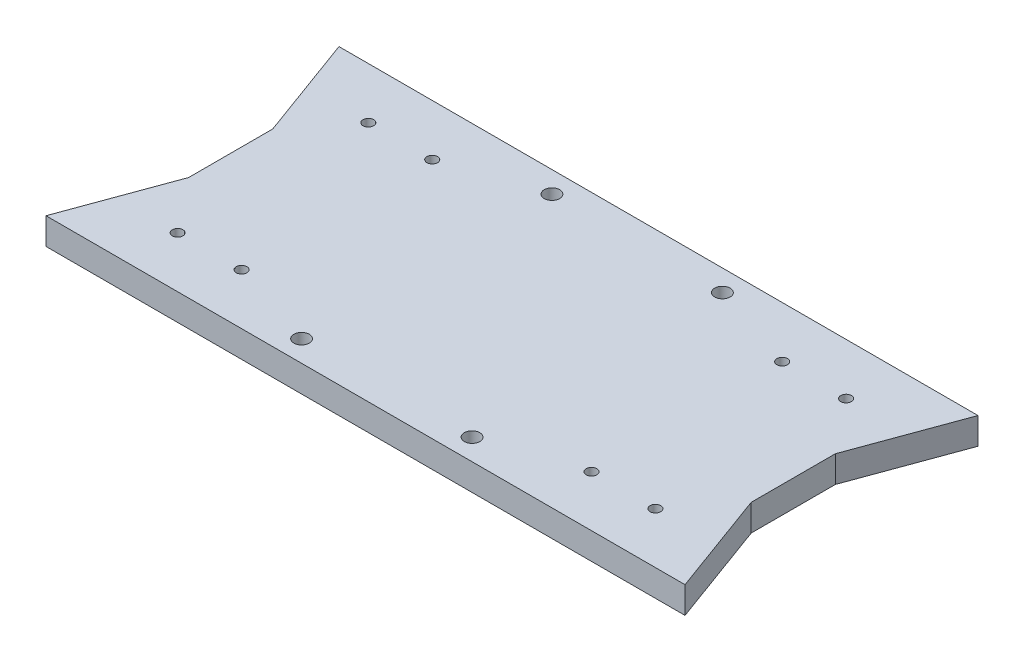
ISO-10303-21;
HEADER;
FILE_DESCRIPTION(('STEP AP214'),'2;1');
FILE_NAME('part.step','',(''),(''),'','','');
FILE_SCHEMA(('AUTOMOTIVE_DESIGN { 1 0 10303 214 1 1 1 1 }'));
ENDSEC;
DATA;
#1=APPLICATION_CONTEXT('core data for automotive mechanical design processes');
#2=APPLICATION_PROTOCOL_DEFINITION('international standard','automotive_design',2000,#1);
#3=PRODUCT_CONTEXT('',#1,'mechanical');
#4=PRODUCT('Part','Part','',(#3));
#5=PRODUCT_RELATED_PRODUCT_CATEGORY('part','',(#4));
#6=PRODUCT_DEFINITION_FORMATION('','',#4);
#7=PRODUCT_DEFINITION_CONTEXT('part definition',#1,'design');
#8=PRODUCT_DEFINITION('design','',#6,#7);
#9=PRODUCT_DEFINITION_SHAPE('','',#8);
#10=(LENGTH_UNIT() NAMED_UNIT(*) SI_UNIT(.MILLI.,.METRE.));
#11=(NAMED_UNIT(*) PLANE_ANGLE_UNIT() SI_UNIT($,.RADIAN.));
#12=(NAMED_UNIT(*) SI_UNIT($,.STERADIAN.) SOLID_ANGLE_UNIT());
#13=UNCERTAINTY_MEASURE_WITH_UNIT(LENGTH_MEASURE(1.E-05),#10,'distance_accuracy_value','');
#14=(GEOMETRIC_REPRESENTATION_CONTEXT(3) GLOBAL_UNCERTAINTY_ASSIGNED_CONTEXT((#13)) GLOBAL_UNIT_ASSIGNED_CONTEXT((#10,
#11,#12)) REPRESENTATION_CONTEXT('',''));
#15=CARTESIAN_POINT('',(0.,0.,0.));
#16=DIRECTION('',(0.,0.,1.));
#17=DIRECTION('',(1.,0.,0.));
#18=AXIS2_PLACEMENT_3D('',#15,#16,#17);
#19=CARTESIAN_POINT('',(-105.394952442636,6.35,-32.7826613509761));
#20=DIRECTION('',(-1.,0.,0.));
#21=DIRECTION('',(0.,0.,1.));
#22=AXIS2_PLACEMENT_3D('',#19,#20,#21);
#23=PLANE('',#22);
#24=DIRECTION('',(0.,0.,1.));
#25=VECTOR('',#24,1.);
#26=CARTESIAN_POINT('',(-105.394952442636,6.35,-32.7826613509761));
#27=LINE('',#26,#25);
#28=CARTESIAN_POINT('',(-105.394952442636,6.35,-77.7376613569761));
#29=VERTEX_POINT('',#28);
#30=CARTESIAN_POINT('',(-105.394952442636,6.35,-57.6776613449761));
#31=VERTEX_POINT('',#30);
#32=EDGE_CURVE('E100',#29,#31,#27,.T.);
#33=ORIENTED_EDGE('',*,*,#32,.F.);
#34=DIRECTION('',(0.,1.,0.));
#35=VECTOR('',#34,1.);
#36=CARTESIAN_POINT('',(-105.394952442636,0.,-77.7376613569761));
#37=LINE('',#36,#35);
#38=CARTESIAN_POINT('',(-105.394952442636,0.,-77.7376613569761));
#39=VERTEX_POINT('',#38);
#40=EDGE_CURVE('E129',#39,#29,#37,.T.);
#41=ORIENTED_EDGE('',*,*,#40,.F.);
#42=DIRECTION('',(0.,0.,-1.));
#43=VECTOR('',#42,1.);
#44=CARTESIAN_POINT('',(-105.394952442636,0.,-32.7826613509761));
#45=LINE('',#44,#43);
#46=CARTESIAN_POINT('',(-105.394952442636,0.,-57.6776613449761));
#47=VERTEX_POINT('',#46);
#48=EDGE_CURVE('E52',#47,#39,#45,.T.);
#49=ORIENTED_EDGE('',*,*,#48,.F.);
#50=DIRECTION('',(0.,1.,0.));
#51=VECTOR('',#50,1.);
#52=CARTESIAN_POINT('',(-105.394952442636,0.,-57.6776613449761));
#53=LINE('',#52,#51);
#54=EDGE_CURVE('E111',#47,#31,#53,.T.);
#55=ORIENTED_EDGE('',*,*,#54,.T.);
#56=EDGE_LOOP('',(#33,#41,#49,#55));
#57=FACE_BOUND('',#56,.T.);
#58=ADVANCED_FACE('F35',(#57),#23,.T.);
#59=CARTESIAN_POINT('',(0.,6.35,0.));
#60=DIRECTION('',(0.,-1.,0.));
#61=DIRECTION('',(0.,0.,-1.));
#62=AXIS2_PLACEMENT_3D('',#59,#60,#61);
#63=PLANE('',#62);
#64=CARTESIAN_POINT('',(-58.653665481045,6.35,-37.8626613509761));
#65=DIRECTION('',(0.,1.,0.));
#66=DIRECTION('',(0.,0.,1.));
#67=AXIS2_PLACEMENT_3D('',#64,#65,#66);
#68=CIRCLE('',#67,1.8415);
#69=CARTESIAN_POINT('',(-58.653665481045,6.35,-36.0211613509761));
#70=VERTEX_POINT('',#69);
#71=EDGE_CURVE('E447',#70,#70,#68,.T.);
#72=ORIENTED_EDGE('',*,*,#71,.F.);
#73=EDGE_LOOP('',(#72));
#74=FACE_BOUND('',#73,.T.);
#75=CARTESIAN_POINT('',(-18.013665481045,6.35,-37.8626613509761));
#76=DIRECTION('',(0.,1.,0.));
#77=DIRECTION('',(0.,0.,1.));
#78=AXIS2_PLACEMENT_3D('',#75,#76,#77);
#79=CIRCLE('',#78,1.8415);
#80=CARTESIAN_POINT('',(-18.013665481045,6.35,-36.0211613509761));
#81=VERTEX_POINT('',#80);
#82=EDGE_CURVE('E444',#81,#81,#79,.T.);
#83=ORIENTED_EDGE('',*,*,#82,.F.);
#84=EDGE_LOOP('',(#83));
#85=FACE_BOUND('',#84,.T.);
#86=CARTESIAN_POINT('',(-18.0136654810452,6.35,-97.552661350976));
#87=DIRECTION('',(0.,1.,0.));
#88=DIRECTION('',(0.,0.,1.));
#89=AXIS2_PLACEMENT_3D('',#86,#87,#88);
#90=CIRCLE('',#89,1.84149999999999);
#91=CARTESIAN_POINT('',(-18.0136654810452,6.35,-95.711161350976));
#92=VERTEX_POINT('',#91);
#93=EDGE_CURVE('E446',#92,#92,#90,.T.);
#94=ORIENTED_EDGE('',*,*,#93,.F.);
#95=EDGE_LOOP('',(#94));
#96=FACE_BOUND('',#95,.T.);
#97=CARTESIAN_POINT('',(-58.6536654810452,6.35,-97.552661350976));
#98=DIRECTION('',(0.,1.,0.));
#99=DIRECTION('',(0.,0.,1.));
#100=AXIS2_PLACEMENT_3D('',#97,#98,#99);
#101=CIRCLE('',#100,1.84149999999999);
#102=CARTESIAN_POINT('',(-58.6536654810452,6.35,-95.711161350976));
#103=VERTEX_POINT('',#102);
#104=EDGE_CURVE('E216',#103,#103,#101,.T.);
#105=ORIENTED_EDGE('',*,*,#104,.F.);
#106=EDGE_LOOP('',(#105));
#107=FACE_BOUND('',#106,.T.);
#108=ORIENTED_EDGE('',*,*,#32,.T.);
#109=DIRECTION('',(0.343774305183413,0.,-0.939052302641158));
#110=VECTOR('',#109,1.);
#111=CARTESIAN_POINT('',(-105.394952442636,6.35,-57.6776613449761));
#112=LINE('',#111,#110);
#113=CARTESIAN_POINT('',(-114.508674118636,6.35,-32.7826613509761));
#114=VERTEX_POINT('',#113);
#115=EDGE_CURVE('E104',#114,#31,#112,.T.);
#116=ORIENTED_EDGE('',*,*,#115,.F.);
#117=DIRECTION('',(1.,0.,0.));
#118=VECTOR('',#117,1.);
#119=CARTESIAN_POINT('',(-38.3336654810452,6.35,-32.7826613509761));
#120=LINE('',#119,#118);
#121=CARTESIAN_POINT('',(37.8413431565453,6.35,-32.7826613509761));
#122=VERTEX_POINT('',#121);
#123=EDGE_CURVE('E44',#114,#122,#120,.T.);
#124=ORIENTED_EDGE('',*,*,#123,.T.);
#125=DIRECTION('',(-0.343774305183413,0.,-0.939052302641158));
#126=VECTOR('',#125,1.);
#127=CARTESIAN_POINT('',(28.7276214805453,6.35,-57.6776613449761));
#128=LINE('',#127,#126);
#129=CARTESIAN_POINT('',(28.7276214805453,6.35,-57.6776613449761));
#130=VERTEX_POINT('',#129);
#131=EDGE_CURVE('E158',#122,#130,#128,.T.);
#132=ORIENTED_EDGE('',*,*,#131,.T.);
#133=DIRECTION('',(0.,0.,1.));
#134=VECTOR('',#133,1.);
#135=CARTESIAN_POINT('',(28.7276214805453,6.35,-32.7826613509761));
#136=LINE('',#135,#134);
#137=CARTESIAN_POINT('',(28.7276214805453,6.35,-77.7376613569761));
#138=VERTEX_POINT('',#137);
#139=EDGE_CURVE('E108',#138,#130,#136,.T.);
#140=ORIENTED_EDGE('',*,*,#139,.F.);
#141=DIRECTION('',(0.343774305183414,0.,-0.939052302641158));
#142=VECTOR('',#141,1.);
#143=CARTESIAN_POINT('',(37.8413431565453,6.35,-102.632661350976));
#144=LINE('',#143,#142);
#145=CARTESIAN_POINT('',(37.8413431565453,6.35,-102.632661350976));
#146=VERTEX_POINT('',#145);
#147=EDGE_CURVE('E167',#138,#146,#144,.T.);
#148=ORIENTED_EDGE('',*,*,#147,.T.);
#149=DIRECTION('',(-1.,0.,0.));
#150=VECTOR('',#149,1.);
#151=CARTESIAN_POINT('',(-38.3336654810452,6.35,-102.632661350976));
#152=LINE('',#151,#150);
#153=CARTESIAN_POINT('',(-114.508674118636,6.35,-102.632661350976));
#154=VERTEX_POINT('',#153);
#155=EDGE_CURVE('E11',#146,#154,#152,.T.);
#156=ORIENTED_EDGE('',*,*,#155,.T.);
#157=DIRECTION('',(-0.343774305183414,0.,-0.939052302641158));
#158=VECTOR('',#157,1.);
#159=CARTESIAN_POINT('',(-114.508674118636,6.35,-102.632661350976));
#160=LINE('',#159,#158);
#161=EDGE_CURVE('E106',#29,#154,#160,.T.);
#162=ORIENTED_EDGE('',*,*,#161,.F.);
#163=EDGE_LOOP('',(#108,#116,#124,#132,#140,#148,#156,#162));
#164=FACE_BOUND('',#163,.T.);
#165=CARTESIAN_POINT('',(18.6213431565454,6.35,-44.9476613509761));
#166=DIRECTION('',(0.,1.,0.));
#167=DIRECTION('',(0.,0.,1.));
#168=AXIS2_PLACEMENT_3D('',#165,#166,#167);
#169=CIRCLE('',#168,1.27);
#170=CARTESIAN_POINT('',(18.6213431565454,6.35,-43.6776613509761));
#171=VERTEX_POINT('',#170);
#172=EDGE_CURVE('E182',#171,#171,#169,.T.);
#173=ORIENTED_EDGE('',*,*,#172,.F.);
#174=EDGE_LOOP('',(#173));
#175=FACE_BOUND('',#174,.T.);
#176=CARTESIAN_POINT('',(3.38134315654538,6.35,-44.9476613509761));
#177=DIRECTION('',(0.,1.,0.));
#178=DIRECTION('',(0.,0.,1.));
#179=AXIS2_PLACEMENT_3D('',#176,#177,#178);
#180=CIRCLE('',#179,1.27);
#181=CARTESIAN_POINT('',(3.38134315654538,6.35,-43.6776613509761));
#182=VERTEX_POINT('',#181);
#183=EDGE_CURVE('E188',#182,#182,#180,.T.);
#184=ORIENTED_EDGE('',*,*,#183,.F.);
#185=EDGE_LOOP('',(#184));
#186=FACE_BOUND('',#185,.T.);
#187=CARTESIAN_POINT('',(18.6213431565454,6.35,-90.4076613509761));
#188=DIRECTION('',(0.,1.,0.));
#189=DIRECTION('',(0.,0.,1.));
#190=AXIS2_PLACEMENT_3D('',#187,#188,#189);
#191=CIRCLE('',#190,1.27000000000001);
#192=CARTESIAN_POINT('',(18.6213431565454,6.35,-89.137661350976));
#193=VERTEX_POINT('',#192);
#194=EDGE_CURVE('E194',#193,#193,#191,.T.);
#195=ORIENTED_EDGE('',*,*,#194,.F.);
#196=EDGE_LOOP('',(#195));
#197=FACE_BOUND('',#196,.T.);
#198=CARTESIAN_POINT('',(3.38134315654538,6.35,-90.4076613509761));
#199=DIRECTION('',(0.,1.,0.));
#200=DIRECTION('',(0.,0.,1.));
#201=AXIS2_PLACEMENT_3D('',#198,#199,#200);
#202=CIRCLE('',#201,1.27000000000001);
#203=CARTESIAN_POINT('',(3.38134315654538,6.35,-89.137661350976));
#204=VERTEX_POINT('',#203);
#205=EDGE_CURVE('E200',#204,#204,#202,.T.);
#206=ORIENTED_EDGE('',*,*,#205,.F.);
#207=EDGE_LOOP('',(#206));
#208=FACE_BOUND('',#207,.T.);
#209=CARTESIAN_POINT('',(-95.2886741186358,6.35,-44.9476613509761));
#210=DIRECTION('',(0.,-1.,0.));
#211=DIRECTION('',(0.,0.,1.));
#212=AXIS2_PLACEMENT_3D('',#209,#210,#211);
#213=CIRCLE('',#212,1.27);
#214=CARTESIAN_POINT('',(-95.2886741186358,6.35,-43.6776613509761));
#215=VERTEX_POINT('',#214);
#216=EDGE_CURVE('E134',#215,#215,#213,.T.);
#217=ORIENTED_EDGE('',*,*,#216,.T.);
#218=EDGE_LOOP('',(#217));
#219=FACE_BOUND('',#218,.T.);
#220=CARTESIAN_POINT('',(-80.0486741186358,6.35,-44.9476613509761));
#221=DIRECTION('',(0.,-1.,0.));
#222=DIRECTION('',(0.,0.,1.));
#223=AXIS2_PLACEMENT_3D('',#220,#221,#222);
#224=CIRCLE('',#223,1.27);
#225=CARTESIAN_POINT('',(-80.0486741186358,6.35,-43.6776613509761));
#226=VERTEX_POINT('',#225);
#227=EDGE_CURVE('E140',#226,#226,#224,.T.);
#228=ORIENTED_EDGE('',*,*,#227,.T.);
#229=EDGE_LOOP('',(#228));
#230=FACE_BOUND('',#229,.T.);
#231=CARTESIAN_POINT('',(-95.2886741186358,6.35,-90.4076613509761));
#232=DIRECTION('',(0.,-1.,0.));
#233=DIRECTION('',(0.,0.,1.));
#234=AXIS2_PLACEMENT_3D('',#231,#232,#233);
#235=CIRCLE('',#234,1.27000000000001);
#236=CARTESIAN_POINT('',(-95.2886741186358,6.35,-89.137661350976));
#237=VERTEX_POINT('',#236);
#238=EDGE_CURVE('E146',#237,#237,#235,.T.);
#239=ORIENTED_EDGE('',*,*,#238,.T.);
#240=EDGE_LOOP('',(#239));
#241=FACE_BOUND('',#240,.T.);
#242=CARTESIAN_POINT('',(-80.0486741186358,6.35,-90.4076613509761));
#243=DIRECTION('',(0.,-1.,0.));
#244=DIRECTION('',(0.,0.,1.));
#245=AXIS2_PLACEMENT_3D('',#242,#243,#244);
#246=CIRCLE('',#245,1.27000000000001);
#247=CARTESIAN_POINT('',(-80.0486741186358,6.35,-89.137661350976));
#248=VERTEX_POINT('',#247);
#249=EDGE_CURVE('E152',#248,#248,#246,.T.);
#250=ORIENTED_EDGE('',*,*,#249,.T.);
#251=EDGE_LOOP('',(#250));
#252=FACE_BOUND('',#251,.T.);
#253=ADVANCED_FACE('F101',(#74,#85,#96,#107,#164,#175,#186,#197,#208,#219,#230,#241,#252),#63,.F.);
#254=CARTESIAN_POINT('',(0.,0.,0.));
#255=DIRECTION('',(0.,-1.,0.));
#256=DIRECTION('',(0.,0.,-1.));
#257=AXIS2_PLACEMENT_3D('',#254,#255,#256);
#258=PLANE('',#257);
#259=CARTESIAN_POINT('',(-58.653665481045,0.,-37.8626613509761));
#260=DIRECTION('',(0.,-1.,0.));
#261=DIRECTION('',(0.,0.,-1.));
#262=AXIS2_PLACEMENT_3D('',#259,#260,#261);
#263=CIRCLE('',#262,1.8415);
#264=CARTESIAN_POINT('',(-58.653665481045,0.,-39.7041613509761));
#265=VERTEX_POINT('',#264);
#266=EDGE_CURVE('E39',#265,#265,#263,.T.);
#267=ORIENTED_EDGE('',*,*,#266,.F.);
#268=EDGE_LOOP('',(#267));
#269=FACE_BOUND('',#268,.T.);
#270=CARTESIAN_POINT('',(-18.013665481045,0.,-37.8626613509761));
#271=DIRECTION('',(0.,-1.,0.));
#272=DIRECTION('',(0.,0.,-1.));
#273=AXIS2_PLACEMENT_3D('',#270,#271,#272);
#274=CIRCLE('',#273,1.8415);
#275=CARTESIAN_POINT('',(-18.013665481045,0.,-39.7041613509761));
#276=VERTEX_POINT('',#275);
#277=EDGE_CURVE('E218',#276,#276,#274,.T.);
#278=ORIENTED_EDGE('',*,*,#277,.F.);
#279=EDGE_LOOP('',(#278));
#280=FACE_BOUND('',#279,.T.);
#281=CARTESIAN_POINT('',(-18.0136654810452,0.,-97.552661350976));
#282=DIRECTION('',(0.,-1.,0.));
#283=DIRECTION('',(0.,0.,-1.));
#284=AXIS2_PLACEMENT_3D('',#281,#282,#283);
#285=CIRCLE('',#284,1.84149999999999);
#286=CARTESIAN_POINT('',(-18.0136654810452,0.,-99.394161350976));
#287=VERTEX_POINT('',#286);
#288=EDGE_CURVE('E215',#287,#287,#285,.T.);
#289=ORIENTED_EDGE('',*,*,#288,.F.);
#290=EDGE_LOOP('',(#289));
#291=FACE_BOUND('',#290,.T.);
#292=CARTESIAN_POINT('',(-58.6536654810452,0.,-97.552661350976));
#293=DIRECTION('',(0.,-1.,0.));
#294=DIRECTION('',(0.,0.,-1.));
#295=AXIS2_PLACEMENT_3D('',#292,#293,#294);
#296=CIRCLE('',#295,1.84149999999999);
#297=CARTESIAN_POINT('',(-58.6536654810452,0.,-99.394161350976));
#298=VERTEX_POINT('',#297);
#299=EDGE_CURVE('E212',#298,#298,#296,.T.);
#300=ORIENTED_EDGE('',*,*,#299,.F.);
#301=EDGE_LOOP('',(#300));
#302=FACE_BOUND('',#301,.T.);
#303=CARTESIAN_POINT('',(3.38134315654538,0.,-44.9476613509761));
#304=DIRECTION('',(0.,1.,0.));
#305=DIRECTION('',(0.,0.,1.));
#306=AXIS2_PLACEMENT_3D('',#303,#304,#305);
#307=CIRCLE('',#306,1.27);
#308=CARTESIAN_POINT('',(3.38134315654538,0.,-43.6776613509761));
#309=VERTEX_POINT('',#308);
#310=EDGE_CURVE('E185',#309,#309,#307,.T.);
#311=ORIENTED_EDGE('',*,*,#310,.T.);
#312=EDGE_LOOP('',(#311));
#313=FACE_BOUND('',#312,.T.);
#314=CARTESIAN_POINT('',(3.38134315654538,0.,-90.4076613509761));
#315=DIRECTION('',(0.,1.,0.));
#316=DIRECTION('',(0.,0.,1.));
#317=AXIS2_PLACEMENT_3D('',#314,#315,#316);
#318=CIRCLE('',#317,1.27000000000001);
#319=CARTESIAN_POINT('',(3.38134315654538,0.,-89.137661350976));
#320=VERTEX_POINT('',#319);
#321=EDGE_CURVE('E197',#320,#320,#318,.T.);
#322=ORIENTED_EDGE('',*,*,#321,.T.);
#323=EDGE_LOOP('',(#322));
#324=FACE_BOUND('',#323,.T.);
#325=DIRECTION('',(1.,0.,0.));
#326=VECTOR('',#325,1.);
#327=CARTESIAN_POINT('',(-38.3336654810452,0.,-32.7826613509761));
#328=LINE('',#327,#326);
#329=CARTESIAN_POINT('',(-114.508674118636,0.,-32.7826613509761));
#330=VERTEX_POINT('',#329);
#331=CARTESIAN_POINT('',(37.8413431565453,0.,-32.7826613509761));
#332=VERTEX_POINT('',#331);
#333=EDGE_CURVE('E203',#330,#332,#328,.T.);
#334=ORIENTED_EDGE('',*,*,#333,.F.);
#335=DIRECTION('',(0.343774305183413,0.,-0.939052302641158));
#336=VECTOR('',#335,1.);
#337=CARTESIAN_POINT('',(-105.394952442636,0.,-57.6776613449761));
#338=LINE('',#337,#336);
#339=EDGE_CURVE('E115',#330,#47,#338,.T.);
#340=ORIENTED_EDGE('',*,*,#339,.T.);
#341=ORIENTED_EDGE('',*,*,#48,.T.);
#342=DIRECTION('',(-0.343774305183414,0.,-0.939052302641158));
#343=VECTOR('',#342,1.);
#344=CARTESIAN_POINT('',(-114.508674118636,0.,-102.632661350976));
#345=LINE('',#344,#343);
#346=CARTESIAN_POINT('',(-114.508674118636,0.,-102.632661350976));
#347=VERTEX_POINT('',#346);
#348=EDGE_CURVE('E125',#39,#347,#345,.T.);
#349=ORIENTED_EDGE('',*,*,#348,.T.);
#350=DIRECTION('',(-1.,0.,0.));
#351=VECTOR('',#350,1.);
#352=CARTESIAN_POINT('',(-38.3336654810452,0.,-102.632661350976));
#353=LINE('',#352,#351);
#354=CARTESIAN_POINT('',(37.8413431565453,0.,-102.632661350976));
#355=VERTEX_POINT('',#354);
#356=EDGE_CURVE('E206',#355,#347,#353,.T.);
#357=ORIENTED_EDGE('',*,*,#356,.F.);
#358=DIRECTION('',(0.343774305183414,0.,-0.939052302641158));
#359=VECTOR('',#358,1.);
#360=CARTESIAN_POINT('',(37.8413431565453,0.,-102.632661350976));
#361=LINE('',#360,#359);
#362=CARTESIAN_POINT('',(28.7276214805453,0.,-77.7376613569761));
#363=VERTEX_POINT('',#362);
#364=EDGE_CURVE('E170',#363,#355,#361,.T.);
#365=ORIENTED_EDGE('',*,*,#364,.F.);
#366=DIRECTION('',(0.,0.,-1.));
#367=VECTOR('',#366,1.);
#368=CARTESIAN_POINT('',(28.7276214805453,0.,-32.7826613509761));
#369=LINE('',#368,#367);
#370=CARTESIAN_POINT('',(28.7276214805453,0.,-57.6776613449761));
#371=VERTEX_POINT('',#370);
#372=EDGE_CURVE('E209',#371,#363,#369,.T.);
#373=ORIENTED_EDGE('',*,*,#372,.F.);
#374=DIRECTION('',(-0.343774305183413,0.,-0.939052302641158));
#375=VECTOR('',#374,1.);
#376=CARTESIAN_POINT('',(28.7276214805453,0.,-57.6776613449761));
#377=LINE('',#376,#375);
#378=EDGE_CURVE('E159',#332,#371,#377,.T.);
#379=ORIENTED_EDGE('',*,*,#378,.F.);
#380=EDGE_LOOP('',(#334,#340,#341,#349,#357,#365,#373,#379));
#381=FACE_BOUND('',#380,.T.);
#382=CARTESIAN_POINT('',(18.6213431565454,0.,-90.4076613509761));
#383=DIRECTION('',(0.,1.,0.));
#384=DIRECTION('',(0.,0.,1.));
#385=AXIS2_PLACEMENT_3D('',#382,#383,#384);
#386=CIRCLE('',#385,1.27000000000001);
#387=CARTESIAN_POINT('',(18.6213431565454,0.,-89.137661350976));
#388=VERTEX_POINT('',#387);
#389=EDGE_CURVE('E191',#388,#388,#386,.T.);
#390=ORIENTED_EDGE('',*,*,#389,.T.);
#391=EDGE_LOOP('',(#390));
#392=FACE_BOUND('',#391,.T.);
#393=CARTESIAN_POINT('',(18.6213431565454,0.,-44.9476613509761));
#394=DIRECTION('',(0.,1.,0.));
#395=DIRECTION('',(0.,0.,1.));
#396=AXIS2_PLACEMENT_3D('',#393,#394,#395);
#397=CIRCLE('',#396,1.27);
#398=CARTESIAN_POINT('',(18.6213431565454,0.,-43.6776613509761));
#399=VERTEX_POINT('',#398);
#400=EDGE_CURVE('E179',#399,#399,#397,.T.);
#401=ORIENTED_EDGE('',*,*,#400,.T.);
#402=EDGE_LOOP('',(#401));
#403=FACE_BOUND('',#402,.T.);
#404=CARTESIAN_POINT('',(-95.2886741186358,0.,-44.9476613509761));
#405=DIRECTION('',(0.,-1.,0.));
#406=DIRECTION('',(0.,0.,1.));
#407=AXIS2_PLACEMENT_3D('',#404,#405,#406);
#408=CIRCLE('',#407,1.27);
#409=CARTESIAN_POINT('',(-95.2886741186358,0.,-43.6776613509761));
#410=VERTEX_POINT('',#409);
#411=EDGE_CURVE('E131',#410,#410,#408,.T.);
#412=ORIENTED_EDGE('',*,*,#411,.F.);
#413=EDGE_LOOP('',(#412));
#414=FACE_BOUND('',#413,.T.);
#415=CARTESIAN_POINT('',(-80.0486741186358,0.,-44.9476613509761));
#416=DIRECTION('',(0.,-1.,0.));
#417=DIRECTION('',(0.,0.,1.));
#418=AXIS2_PLACEMENT_3D('',#415,#416,#417);
#419=CIRCLE('',#418,1.27);
#420=CARTESIAN_POINT('',(-80.0486741186358,0.,-43.6776613509761));
#421=VERTEX_POINT('',#420);
#422=EDGE_CURVE('E137',#421,#421,#419,.T.);
#423=ORIENTED_EDGE('',*,*,#422,.F.);
#424=EDGE_LOOP('',(#423));
#425=FACE_BOUND('',#424,.T.);
#426=CARTESIAN_POINT('',(-95.2886741186358,0.,-90.4076613509761));
#427=DIRECTION('',(0.,-1.,0.));
#428=DIRECTION('',(0.,0.,1.));
#429=AXIS2_PLACEMENT_3D('',#426,#427,#428);
#430=CIRCLE('',#429,1.27000000000001);
#431=CARTESIAN_POINT('',(-95.2886741186358,0.,-89.137661350976));
#432=VERTEX_POINT('',#431);
#433=EDGE_CURVE('E143',#432,#432,#430,.T.);
#434=ORIENTED_EDGE('',*,*,#433,.F.);
#435=EDGE_LOOP('',(#434));
#436=FACE_BOUND('',#435,.T.);
#437=CARTESIAN_POINT('',(-80.0486741186358,0.,-90.4076613509761));
#438=DIRECTION('',(0.,-1.,0.));
#439=DIRECTION('',(0.,0.,1.));
#440=AXIS2_PLACEMENT_3D('',#437,#438,#439);
#441=CIRCLE('',#440,1.27000000000001);
#442=CARTESIAN_POINT('',(-80.0486741186358,0.,-89.137661350976));
#443=VERTEX_POINT('',#442);
#444=EDGE_CURVE('E149',#443,#443,#441,.T.);
#445=ORIENTED_EDGE('',*,*,#444,.F.);
#446=EDGE_LOOP('',(#445));
#447=FACE_BOUND('',#446,.T.);
#448=ADVANCED_FACE('F228',(#269,#280,#291,#302,#313,#324,#381,#392,#403,#414,#425,#436,#447),
#258,.T.);
#449=CARTESIAN_POINT('',(-38.3336654810452,6.35,-32.7826613509761));
#450=DIRECTION('',(0.,0.,-1.));
#451=DIRECTION('',(-1.,0.,0.));
#452=AXIS2_PLACEMENT_3D('',#449,#450,#451);
#453=PLANE('',#452);
#454=ORIENTED_EDGE('',*,*,#333,.T.);
#455=DIRECTION('',(0.,1.,0.));
#456=VECTOR('',#455,1.);
#457=CARTESIAN_POINT('',(37.8413431565453,0.,-32.7826613509761));
#458=LINE('',#457,#456);
#459=EDGE_CURVE('E161',#332,#122,#458,.T.);
#460=ORIENTED_EDGE('',*,*,#459,.T.);
#461=ORIENTED_EDGE('',*,*,#123,.F.);
#462=DIRECTION('',(0.,1.,0.));
#463=VECTOR('',#462,1.);
#464=CARTESIAN_POINT('',(-114.508674118636,0.,-32.7826613509761));
#465=LINE('',#464,#463);
#466=EDGE_CURVE('E114',#330,#114,#465,.T.);
#467=ORIENTED_EDGE('',*,*,#466,.F.);
#468=EDGE_LOOP('',(#454,#460,#461,#467));
#469=FACE_BOUND('',#468,.T.);
#470=ADVANCED_FACE('F37',(#469),#453,.F.);
#471=CARTESIAN_POINT('',(28.7276214805453,6.35,-32.7826613509761));
#472=DIRECTION('',(-1.,0.,0.));
#473=DIRECTION('',(0.,0.,1.));
#474=AXIS2_PLACEMENT_3D('',#471,#472,#473);
#475=PLANE('',#474);
#476=DIRECTION('',(0.,1.,0.));
#477=VECTOR('',#476,1.);
#478=CARTESIAN_POINT('',(28.7276214805453,0.,-77.7376613569761));
#479=LINE('',#478,#477);
#480=EDGE_CURVE('E173',#363,#138,#479,.T.);
#481=ORIENTED_EDGE('',*,*,#480,.T.);
#482=ORIENTED_EDGE('',*,*,#139,.T.);
#483=DIRECTION('',(0.,1.,0.));
#484=VECTOR('',#483,1.);
#485=CARTESIAN_POINT('',(28.7276214805453,0.,-57.6776613449761));
#486=LINE('',#485,#484);
#487=EDGE_CURVE('E164',#371,#130,#486,.T.);
#488=ORIENTED_EDGE('',*,*,#487,.F.);
#489=ORIENTED_EDGE('',*,*,#372,.T.);
#490=EDGE_LOOP('',(#481,#482,#488,#489));
#491=FACE_BOUND('',#490,.T.);
#492=ADVANCED_FACE('F300',(#491),#475,.F.);
#493=CARTESIAN_POINT('',(-38.3336654810452,6.35,-102.632661350976));
#494=DIRECTION('',(0.,0.,1.));
#495=DIRECTION('',(1.,0.,0.));
#496=AXIS2_PLACEMENT_3D('',#493,#494,#495);
#497=PLANE('',#496);
#498=ORIENTED_EDGE('',*,*,#356,.T.);
#499=DIRECTION('',(0.,1.,0.));
#500=VECTOR('',#499,1.);
#501=CARTESIAN_POINT('',(-114.508674118636,0.,-102.632661350976));
#502=LINE('',#501,#500);
#503=EDGE_CURVE('E127',#347,#154,#502,.T.);
#504=ORIENTED_EDGE('',*,*,#503,.T.);
#505=ORIENTED_EDGE('',*,*,#155,.F.);
#506=DIRECTION('',(0.,1.,0.));
#507=VECTOR('',#506,1.);
#508=CARTESIAN_POINT('',(37.8413431565453,0.,-102.632661350976));
#509=LINE('',#508,#507);
#510=EDGE_CURVE('E176',#355,#146,#509,.T.);
#511=ORIENTED_EDGE('',*,*,#510,.F.);
#512=EDGE_LOOP('',(#498,#504,#505,#511));
#513=FACE_BOUND('',#512,.T.);
#514=ADVANCED_FACE('F296',(#513),#497,.F.);
#515=CARTESIAN_POINT('',(3.38134315654538,6.35,-90.4076613509761));
#516=DIRECTION('',(0.,-1.,0.));
#517=DIRECTION('',(0.,0.,-1.));
#518=AXIS2_PLACEMENT_3D('',#515,#516,#517);
#519=CYLINDRICAL_SURFACE('',#518,1.27000000000001);
#520=ORIENTED_EDGE('',*,*,#205,.T.);
#521=EDGE_LOOP('',(#520));
#522=FACE_BOUND('',#521,.T.);
#523=ORIENTED_EDGE('',*,*,#321,.F.);
#524=EDGE_LOOP('',(#523));
#525=FACE_BOUND('',#524,.T.);
#526=ADVANCED_FACE('F293',(#522,#525),#519,.F.);
#527=CARTESIAN_POINT('',(18.6213431565454,6.35,-90.4076613509761));
#528=DIRECTION('',(0.,-1.,0.));
#529=DIRECTION('',(0.,0.,-1.));
#530=AXIS2_PLACEMENT_3D('',#527,#528,#529);
#531=CYLINDRICAL_SURFACE('',#530,1.27000000000001);
#532=ORIENTED_EDGE('',*,*,#194,.T.);
#533=EDGE_LOOP('',(#532));
#534=FACE_BOUND('',#533,.T.);
#535=ORIENTED_EDGE('',*,*,#389,.F.);
#536=EDGE_LOOP('',(#535));
#537=FACE_BOUND('',#536,.T.);
#538=ADVANCED_FACE('F289',(#534,#537),#531,.F.);
#539=CARTESIAN_POINT('',(3.38134315654538,6.35,-44.9476613509761));
#540=DIRECTION('',(0.,-1.,0.));
#541=DIRECTION('',(0.,0.,-1.));
#542=AXIS2_PLACEMENT_3D('',#539,#540,#541);
#543=CYLINDRICAL_SURFACE('',#542,1.27);
#544=ORIENTED_EDGE('',*,*,#183,.T.);
#545=EDGE_LOOP('',(#544));
#546=FACE_BOUND('',#545,.T.);
#547=ORIENTED_EDGE('',*,*,#310,.F.);
#548=EDGE_LOOP('',(#547));
#549=FACE_BOUND('',#548,.T.);
#550=ADVANCED_FACE('F285',(#546,#549),#543,.F.);
#551=CARTESIAN_POINT('',(18.6213431565454,6.35,-44.9476613509761));
#552=DIRECTION('',(0.,-1.,0.));
#553=DIRECTION('',(0.,0.,-1.));
#554=AXIS2_PLACEMENT_3D('',#551,#552,#553);
#555=CYLINDRICAL_SURFACE('',#554,1.27);
#556=ORIENTED_EDGE('',*,*,#172,.T.);
#557=EDGE_LOOP('',(#556));
#558=FACE_BOUND('',#557,.T.);
#559=ORIENTED_EDGE('',*,*,#400,.F.);
#560=EDGE_LOOP('',(#559));
#561=FACE_BOUND('',#560,.T.);
#562=ADVANCED_FACE('F281',(#558,#561),#555,.F.);
#563=CARTESIAN_POINT('',(37.8413431565453,0.,-102.632661350976));
#564=DIRECTION('',(0.939052302641158,0.,0.343774305183414));
#565=DIRECTION('',(0.343774305183414,0.,-0.939052302641158));
#566=AXIS2_PLACEMENT_3D('',#563,#564,#565);
#567=PLANE('',#566);
#568=ORIENTED_EDGE('',*,*,#147,.F.);
#569=ORIENTED_EDGE('',*,*,#480,.F.);
#570=ORIENTED_EDGE('',*,*,#364,.T.);
#571=ORIENTED_EDGE('',*,*,#510,.T.);
#572=EDGE_LOOP('',(#568,#569,#570,#571));
#573=FACE_BOUND('',#572,.T.);
#574=ADVANCED_FACE('F267',(#573),#567,.T.);
#575=CARTESIAN_POINT('',(28.7276214805453,0.,-57.6776613449761));
#576=DIRECTION('',(0.939052302641158,0.,-0.343774305183413));
#577=DIRECTION('',(-0.343774305183413,0.,-0.939052302641158));
#578=AXIS2_PLACEMENT_3D('',#575,#576,#577);
#579=PLANE('',#578);
#580=ORIENTED_EDGE('',*,*,#131,.F.);
#581=ORIENTED_EDGE('',*,*,#459,.F.);
#582=ORIENTED_EDGE('',*,*,#378,.T.);
#583=ORIENTED_EDGE('',*,*,#487,.T.);
#584=EDGE_LOOP('',(#580,#581,#582,#583));
#585=FACE_BOUND('',#584,.T.);
#586=ADVANCED_FACE('F257',(#585),#579,.T.);
#587=CARTESIAN_POINT('',(-80.0486741186358,6.35,-90.4076613509761));
#588=DIRECTION('',(0.,-1.,0.));
#589=DIRECTION('',(0.,0.,-1.));
#590=AXIS2_PLACEMENT_3D('',#587,#588,#589);
#591=CYLINDRICAL_SURFACE('',#590,1.27000000000001);
#592=ORIENTED_EDGE('',*,*,#249,.F.);
#593=EDGE_LOOP('',(#592));
#594=FACE_BOUND('',#593,.T.);
#595=ORIENTED_EDGE('',*,*,#444,.T.);
#596=EDGE_LOOP('',(#595));
#597=FACE_BOUND('',#596,.T.);
#598=ADVANCED_FACE('F254',(#594,#597),#591,.F.);
#599=CARTESIAN_POINT('',(-95.2886741186358,6.35,-90.4076613509761));
#600=DIRECTION('',(0.,-1.,0.));
#601=DIRECTION('',(0.,0.,-1.));
#602=AXIS2_PLACEMENT_3D('',#599,#600,#601);
#603=CYLINDRICAL_SURFACE('',#602,1.27000000000001);
#604=ORIENTED_EDGE('',*,*,#238,.F.);
#605=EDGE_LOOP('',(#604));
#606=FACE_BOUND('',#605,.T.);
#607=ORIENTED_EDGE('',*,*,#433,.T.);
#608=EDGE_LOOP('',(#607));
#609=FACE_BOUND('',#608,.T.);
#610=ADVANCED_FACE('F256',(#606,#609),#603,.F.);
#611=CARTESIAN_POINT('',(-80.0486741186358,6.35,-44.9476613509761));
#612=DIRECTION('',(0.,-1.,0.));
#613=DIRECTION('',(0.,0.,-1.));
#614=AXIS2_PLACEMENT_3D('',#611,#612,#613);
#615=CYLINDRICAL_SURFACE('',#614,1.27);
#616=ORIENTED_EDGE('',*,*,#227,.F.);
#617=EDGE_LOOP('',(#616));
#618=FACE_BOUND('',#617,.T.);
#619=ORIENTED_EDGE('',*,*,#422,.T.);
#620=EDGE_LOOP('',(#619));
#621=FACE_BOUND('',#620,.T.);
#622=ADVANCED_FACE('F264',(#618,#621),#615,.F.);
#623=CARTESIAN_POINT('',(-95.2886741186358,6.35,-44.9476613509761));
#624=DIRECTION('',(0.,-1.,0.));
#625=DIRECTION('',(0.,0.,-1.));
#626=AXIS2_PLACEMENT_3D('',#623,#624,#625);
#627=CYLINDRICAL_SURFACE('',#626,1.27);
#628=ORIENTED_EDGE('',*,*,#216,.F.);
#629=EDGE_LOOP('',(#628));
#630=FACE_BOUND('',#629,.T.);
#631=ORIENTED_EDGE('',*,*,#411,.T.);
#632=EDGE_LOOP('',(#631));
#633=FACE_BOUND('',#632,.T.);
#634=ADVANCED_FACE('F321',(#630,#633),#627,.F.);
#635=CARTESIAN_POINT('',(-114.508674118636,0.,-102.632661350976));
#636=DIRECTION('',(0.939052302641158,0.,-0.343774305183414));
#637=DIRECTION('',(-0.343774305183414,0.,-0.939052302641158));
#638=AXIS2_PLACEMENT_3D('',#635,#636,#637);
#639=PLANE('',#638);
#640=ORIENTED_EDGE('',*,*,#161,.T.);
#641=ORIENTED_EDGE('',*,*,#503,.F.);
#642=ORIENTED_EDGE('',*,*,#348,.F.);
#643=ORIENTED_EDGE('',*,*,#40,.T.);
#644=EDGE_LOOP('',(#640,#641,#642,#643));
#645=FACE_BOUND('',#644,.T.);
#646=ADVANCED_FACE('F319',(#645),#639,.F.);
#647=CARTESIAN_POINT('',(-105.394952442636,0.,-57.6776613449761));
#648=DIRECTION('',(0.939052302641158,0.,0.343774305183413));
#649=DIRECTION('',(0.343774305183413,0.,-0.939052302641158));
#650=AXIS2_PLACEMENT_3D('',#647,#648,#649);
#651=PLANE('',#650);
#652=ORIENTED_EDGE('',*,*,#115,.T.);
#653=ORIENTED_EDGE('',*,*,#54,.F.);
#654=ORIENTED_EDGE('',*,*,#339,.F.);
#655=ORIENTED_EDGE('',*,*,#466,.T.);
#656=EDGE_LOOP('',(#652,#653,#654,#655));
#657=FACE_BOUND('',#656,.T.);
#658=ADVANCED_FACE('F118',(#657),#651,.F.);
#659=CARTESIAN_POINT('',(-58.6536654810452,-7.36600000000001,-97.552661350976));
#660=DIRECTION('',(0.,1.,0.));
#661=DIRECTION('',(0.,0.,1.));
#662=AXIS2_PLACEMENT_3D('',#659,#660,#661);
#663=CYLINDRICAL_SURFACE('',#662,1.84149999999999);
#664=ORIENTED_EDGE('',*,*,#299,.T.);
#665=EDGE_LOOP('',(#664));
#666=FACE_BOUND('',#665,.T.);
#667=ORIENTED_EDGE('',*,*,#104,.T.);
#668=EDGE_LOOP('',(#667));
#669=FACE_BOUND('',#668,.T.);
#670=ADVANCED_FACE('F327',(#666,#669),#663,.F.);
#671=CARTESIAN_POINT('',(-18.0136654810452,-7.36600000000001,-97.552661350976));
#672=DIRECTION('',(0.,1.,0.));
#673=DIRECTION('',(0.,0.,1.));
#674=AXIS2_PLACEMENT_3D('',#671,#672,#673);
#675=CYLINDRICAL_SURFACE('',#674,1.84149999999999);
#676=ORIENTED_EDGE('',*,*,#288,.T.);
#677=EDGE_LOOP('',(#676));
#678=FACE_BOUND('',#677,.T.);
#679=ORIENTED_EDGE('',*,*,#93,.T.);
#680=EDGE_LOOP('',(#679));
#681=FACE_BOUND('',#680,.T.);
#682=ADVANCED_FACE('F411',(#678,#681),#675,.F.);
#683=CARTESIAN_POINT('',(-18.013665481045,-7.36600000000001,-37.8626613509761));
#684=DIRECTION('',(0.,1.,0.));
#685=DIRECTION('',(0.,0.,1.));
#686=AXIS2_PLACEMENT_3D('',#683,#684,#685);
#687=CYLINDRICAL_SURFACE('',#686,1.8415);
#688=ORIENTED_EDGE('',*,*,#277,.T.);
#689=EDGE_LOOP('',(#688));
#690=FACE_BOUND('',#689,.T.);
#691=ORIENTED_EDGE('',*,*,#82,.T.);
#692=EDGE_LOOP('',(#691));
#693=FACE_BOUND('',#692,.T.);
#694=ADVANCED_FACE('F420',(#690,#693),#687,.F.);
#695=CARTESIAN_POINT('',(-58.653665481045,-7.36600000000001,-37.8626613509761));
#696=DIRECTION('',(0.,1.,0.));
#697=DIRECTION('',(0.,0.,1.));
#698=AXIS2_PLACEMENT_3D('',#695,#696,#697);
#699=CYLINDRICAL_SURFACE('',#698,1.8415);
#700=ORIENTED_EDGE('',*,*,#266,.T.);
#701=EDGE_LOOP('',(#700));
#702=FACE_BOUND('',#701,.T.);
#703=ORIENTED_EDGE('',*,*,#71,.T.);
#704=EDGE_LOOP('',(#703));
#705=FACE_BOUND('',#704,.T.);
#706=ADVANCED_FACE('F225',(#702,#705),#699,.F.);
#707=CLOSED_SHELL('',(#58,#253,#448,#470,#492,#514,#526,#538,#550,#562,#574,#586,#598,#610,#622,
#634,#646,#658,#670,#682,#694,#706));
#708=MANIFOLD_SOLID_BREP('B2',#707);
#709=ADVANCED_BREP_SHAPE_REPRESENTATION('',(#18,#708),#14);
#710=SHAPE_DEFINITION_REPRESENTATION(#9,#709);
ENDSEC;
END-ISO-10303-21;
